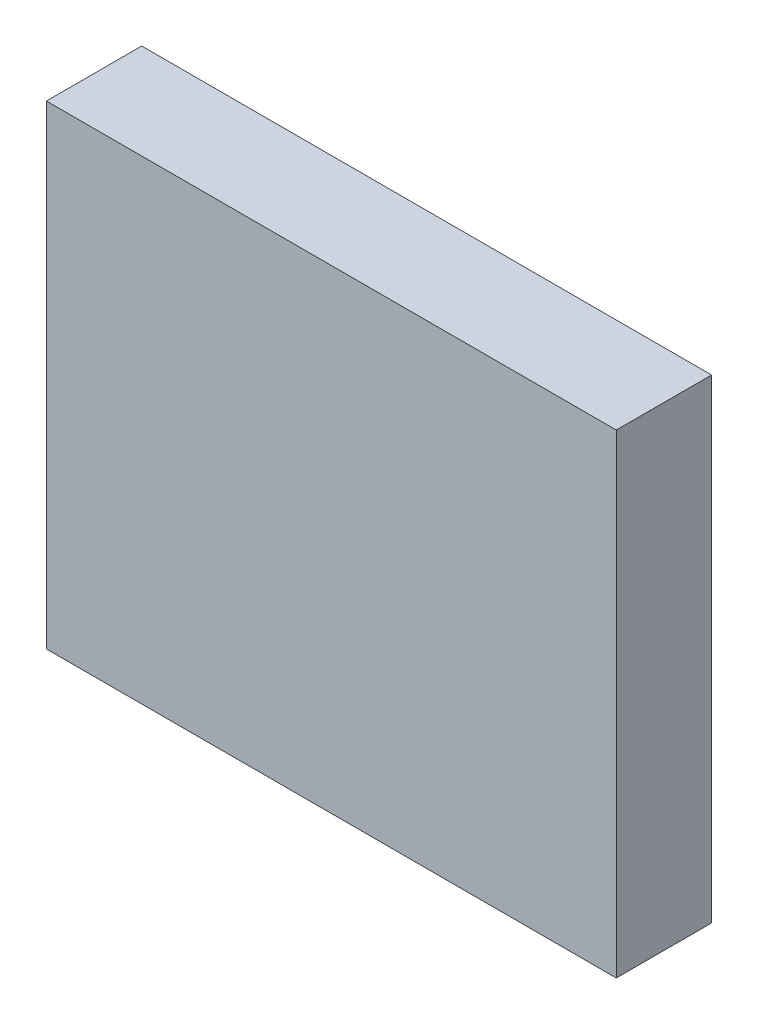
ISO-10303-21;
HEADER;
FILE_DESCRIPTION(('STEP AP214'),'2;1');
FILE_NAME('part.step','',(''),(''),'','','');
FILE_SCHEMA(('AUTOMOTIVE_DESIGN { 1 0 10303 214 1 1 1 1 }'));
ENDSEC;
DATA;
#1=APPLICATION_CONTEXT('core data for automotive mechanical design processes');
#2=APPLICATION_PROTOCOL_DEFINITION('international standard','automotive_design',2000,#1);
#3=PRODUCT_CONTEXT('',#1,'mechanical');
#4=PRODUCT('Part','Part','',(#3));
#5=PRODUCT_RELATED_PRODUCT_CATEGORY('part','',(#4));
#6=PRODUCT_DEFINITION_FORMATION('','',#4);
#7=PRODUCT_DEFINITION_CONTEXT('part definition',#1,'design');
#8=PRODUCT_DEFINITION('design','',#6,#7);
#9=PRODUCT_DEFINITION_SHAPE('','',#8);
#10=(LENGTH_UNIT() NAMED_UNIT(*) SI_UNIT(.MILLI.,.METRE.));
#11=(NAMED_UNIT(*) PLANE_ANGLE_UNIT() SI_UNIT($,.RADIAN.));
#12=(NAMED_UNIT(*) SI_UNIT($,.STERADIAN.) SOLID_ANGLE_UNIT());
#13=UNCERTAINTY_MEASURE_WITH_UNIT(LENGTH_MEASURE(1.E-05),#10,'distance_accuracy_value','');
#14=(GEOMETRIC_REPRESENTATION_CONTEXT(3) GLOBAL_UNCERTAINTY_ASSIGNED_CONTEXT((#13)) GLOBAL_UNIT_ASSIGNED_CONTEXT((#10,
#11,#12)) REPRESENTATION_CONTEXT('',''));
#15=CARTESIAN_POINT('',(0.,0.,0.));
#16=DIRECTION('',(0.,0.,1.));
#17=DIRECTION('',(1.,0.,0.));
#18=AXIS2_PLACEMENT_3D('',#15,#16,#17);
#19=CARTESIAN_POINT('',(0.698,-0.627,0.));
#20=DIRECTION('',(0.,-1.,0.));
#21=DIRECTION('',(0.,0.,1.));
#22=AXIS2_PLACEMENT_3D('',#19,#20,#21);
#23=PLANE('',#22);
#24=DIRECTION('',(-1.,0.,0.));
#25=VECTOR('',#24,1.);
#26=CARTESIAN_POINT('',(1.003,-0.627,0.));
#27=LINE('',#26,#25);
#28=CARTESIAN_POINT('',(1.003,-0.627,0.));
#29=VERTEX_POINT('',#28);
#30=CARTESIAN_POINT('',(0.698,-0.627,0.));
#31=VERTEX_POINT('',#30);
#32=EDGE_CURVE('E11',#29,#31,#27,.T.);
#33=ORIENTED_EDGE('',*,*,#32,.F.);
#34=DIRECTION('',(0.,0.,-1.));
#35=VECTOR('',#34,1.);
#36=CARTESIAN_POINT('',(1.003,-0.627,0.051));
#37=LINE('',#36,#35);
#38=CARTESIAN_POINT('',(1.003,-0.627,0.051));
#39=VERTEX_POINT('',#38);
#40=EDGE_CURVE('E24',#39,#29,#37,.T.);
#41=ORIENTED_EDGE('',*,*,#40,.F.);
#42=DIRECTION('',(1.,0.,0.));
#43=VECTOR('',#42,1.);
#44=CARTESIAN_POINT('',(0.698,-0.627,0.051));
#45=LINE('',#44,#43);
#46=CARTESIAN_POINT('',(0.698,-0.627,0.051));
#47=VERTEX_POINT('',#46);
#48=EDGE_CURVE('E88',#47,#39,#45,.T.);
#49=ORIENTED_EDGE('',*,*,#48,.F.);
#50=DIRECTION('',(0.,0.,1.));
#51=VECTOR('',#50,1.);
#52=CARTESIAN_POINT('',(0.698,-0.627,0.));
#53=LINE('',#52,#51);
#54=EDGE_CURVE('E77',#31,#47,#53,.T.);
#55=ORIENTED_EDGE('',*,*,#54,.F.);
#56=EDGE_LOOP('',(#33,#41,#49,#55));
#57=FACE_BOUND('',#56,.T.);
#58=ADVANCED_FACE('F17',(#57),#23,.T.);
#59=CARTESIAN_POINT('',(1.003,-0.627,0.));
#60=DIRECTION('',(1.,0.,0.));
#61=DIRECTION('',(0.,0.,1.));
#62=AXIS2_PLACEMENT_3D('',#59,#60,#61);
#63=PLANE('',#62);
#64=DIRECTION('',(0.,-1.,0.));
#65=VECTOR('',#64,1.);
#66=CARTESIAN_POINT('',(1.003,-0.373,0.));
#67=LINE('',#66,#65);
#68=CARTESIAN_POINT('',(1.003,-0.373,0.));
#69=VERTEX_POINT('',#68);
#70=EDGE_CURVE('E85',#69,#29,#67,.T.);
#71=ORIENTED_EDGE('',*,*,#70,.F.);
#72=DIRECTION('',(0.,0.,-1.));
#73=VECTOR('',#72,1.);
#74=CARTESIAN_POINT('',(1.003,-0.373,0.051));
#75=LINE('',#74,#73);
#76=CARTESIAN_POINT('',(1.003,-0.373,0.051));
#77=VERTEX_POINT('',#76);
#78=EDGE_CURVE('E83',#77,#69,#75,.T.);
#79=ORIENTED_EDGE('',*,*,#78,.F.);
#80=DIRECTION('',(0.,1.,0.));
#81=VECTOR('',#80,1.);
#82=CARTESIAN_POINT('',(1.003,-0.627,0.051));
#83=LINE('',#82,#81);
#84=EDGE_CURVE('E72',#39,#77,#83,.T.);
#85=ORIENTED_EDGE('',*,*,#84,.F.);
#86=ORIENTED_EDGE('',*,*,#40,.T.);
#87=EDGE_LOOP('',(#71,#79,#85,#86));
#88=FACE_BOUND('',#87,.T.);
#89=ADVANCED_FACE('F90',(#88),#63,.T.);
#90=CARTESIAN_POINT('',(1.003,-0.373,0.));
#91=DIRECTION('',(0.,1.,0.));
#92=DIRECTION('',(0.,0.,1.));
#93=AXIS2_PLACEMENT_3D('',#90,#91,#92);
#94=PLANE('',#93);
#95=DIRECTION('',(1.,0.,0.));
#96=VECTOR('',#95,1.);
#97=CARTESIAN_POINT('',(0.698,-0.373,0.));
#98=LINE('',#97,#96);
#99=CARTESIAN_POINT('',(0.698,-0.373,0.));
#100=VERTEX_POINT('',#99);
#101=EDGE_CURVE('E60',#100,#69,#98,.T.);
#102=ORIENTED_EDGE('',*,*,#101,.F.);
#103=DIRECTION('',(0.,0.,-1.));
#104=VECTOR('',#103,1.);
#105=CARTESIAN_POINT('',(0.698,-0.373,0.051));
#106=LINE('',#105,#104);
#107=CARTESIAN_POINT('',(0.698,-0.373,0.051));
#108=VERTEX_POINT('',#107);
#109=EDGE_CURVE('E54',#108,#100,#106,.T.);
#110=ORIENTED_EDGE('',*,*,#109,.F.);
#111=DIRECTION('',(-1.,0.,0.));
#112=VECTOR('',#111,1.);
#113=CARTESIAN_POINT('',(1.003,-0.373,0.051));
#114=LINE('',#113,#112);
#115=EDGE_CURVE('E58',#77,#108,#114,.T.);
#116=ORIENTED_EDGE('',*,*,#115,.F.);
#117=ORIENTED_EDGE('',*,*,#78,.T.);
#118=EDGE_LOOP('',(#102,#110,#116,#117));
#119=FACE_BOUND('',#118,.T.);
#120=ADVANCED_FACE('F56',(#119),#94,.T.);
#121=CARTESIAN_POINT('',(0.698,-0.373,0.));
#122=DIRECTION('',(-1.,0.,0.));
#123=DIRECTION('',(0.,0.,1.));
#124=AXIS2_PLACEMENT_3D('',#121,#122,#123);
#125=PLANE('',#124);
#126=DIRECTION('',(0.,1.,0.));
#127=VECTOR('',#126,1.);
#128=CARTESIAN_POINT('',(0.698,-0.627,0.));
#129=LINE('',#128,#127);
#130=EDGE_CURVE('E73',#31,#100,#129,.T.);
#131=ORIENTED_EDGE('',*,*,#130,.F.);
#132=ORIENTED_EDGE('',*,*,#54,.T.);
#133=DIRECTION('',(0.,-1.,0.));
#134=VECTOR('',#133,1.);
#135=CARTESIAN_POINT('',(0.698,-0.373,0.051));
#136=LINE('',#135,#134);
#137=EDGE_CURVE('E70',#108,#47,#136,.T.);
#138=ORIENTED_EDGE('',*,*,#137,.F.);
#139=ORIENTED_EDGE('',*,*,#109,.T.);
#140=EDGE_LOOP('',(#131,#132,#138,#139));
#141=FACE_BOUND('',#140,.T.);
#142=ADVANCED_FACE('F76',(#141),#125,.T.);
#143=CARTESIAN_POINT('',(0.698,-0.373,0.));
#144=DIRECTION('',(0.,0.,-1.));
#145=DIRECTION('',(0.,1.,0.));
#146=AXIS2_PLACEMENT_3D('',#143,#144,#145);
#147=PLANE('',#146);
#148=ORIENTED_EDGE('',*,*,#101,.T.);
#149=ORIENTED_EDGE('',*,*,#70,.T.);
#150=ORIENTED_EDGE('',*,*,#32,.T.);
#151=ORIENTED_EDGE('',*,*,#130,.T.);
#152=EDGE_LOOP('',(#148,#149,#150,#151));
#153=FACE_BOUND('',#152,.T.);
#154=ADVANCED_FACE('F91',(#153),#147,.T.);
#155=CARTESIAN_POINT('',(0.698,-0.627,0.051));
#156=DIRECTION('',(0.,0.,1.));
#157=DIRECTION('',(0.,1.,0.));
#158=AXIS2_PLACEMENT_3D('',#155,#156,#157);
#159=PLANE('',#158);
#160=ORIENTED_EDGE('',*,*,#48,.T.);
#161=ORIENTED_EDGE('',*,*,#84,.T.);
#162=ORIENTED_EDGE('',*,*,#115,.T.);
#163=ORIENTED_EDGE('',*,*,#137,.T.);
#164=EDGE_LOOP('',(#160,#161,#162,#163));
#165=FACE_BOUND('',#164,.T.);
#166=ADVANCED_FACE('F69',(#165),#159,.T.);
#167=CLOSED_SHELL('',(#58,#89,#120,#142,#154,#166));
#168=MANIFOLD_SOLID_BREP('B1',#167);
#169=ADVANCED_BREP_SHAPE_REPRESENTATION('',(#18,#168),#14);
#170=SHAPE_DEFINITION_REPRESENTATION(#9,#169);
ENDSEC;
END-ISO-10303-21;
